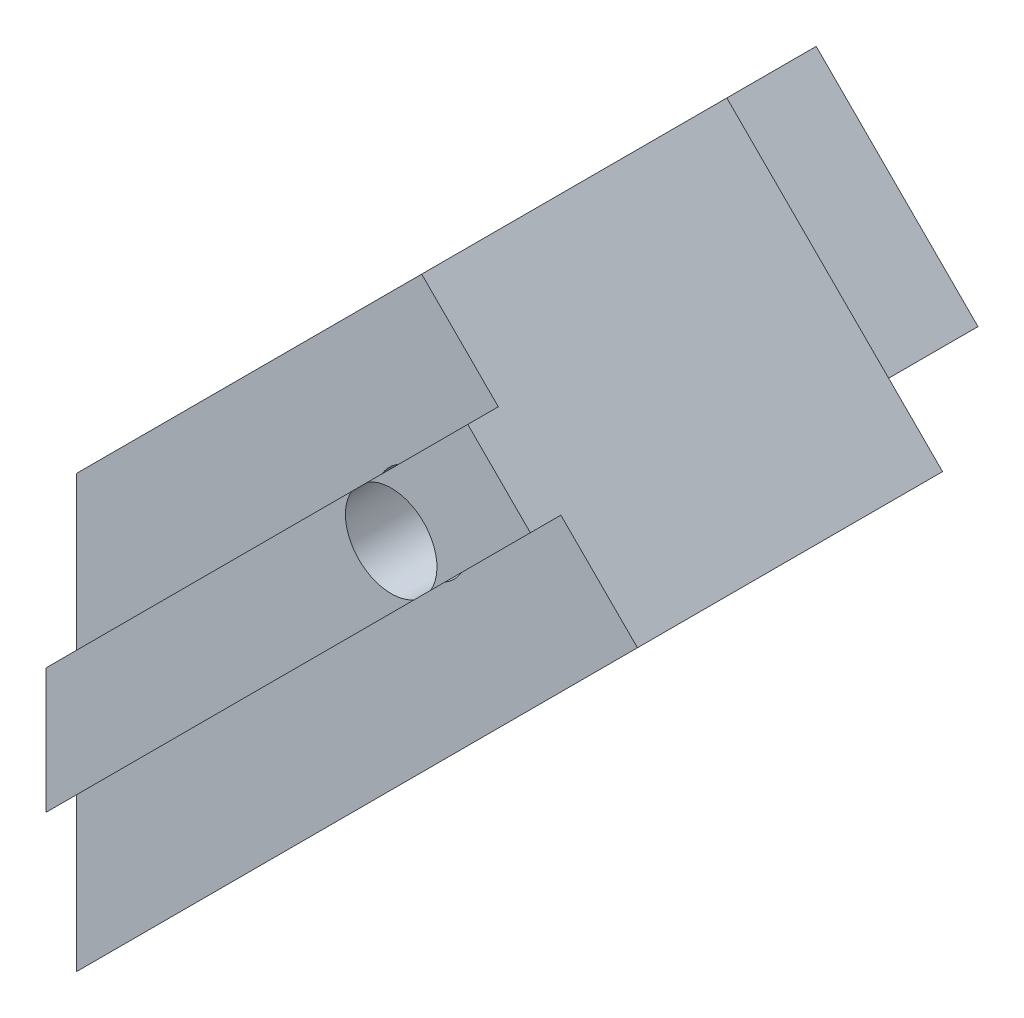
ISO-10303-21;
HEADER;
FILE_DESCRIPTION(('STEP AP214'),'2;1');
FILE_NAME('part.step','',(''),(''),'','','');
FILE_SCHEMA(('AUTOMOTIVE_DESIGN { 1 0 10303 214 1 1 1 1 }'));
ENDSEC;
DATA;
#1=APPLICATION_CONTEXT('core data for automotive mechanical design processes');
#2=APPLICATION_PROTOCOL_DEFINITION('international standard','automotive_design',2000,#1);
#3=PRODUCT_CONTEXT('',#1,'mechanical');
#4=PRODUCT('Part','Part','',(#3));
#5=PRODUCT_RELATED_PRODUCT_CATEGORY('part','',(#4));
#6=PRODUCT_DEFINITION_FORMATION('','',#4);
#7=PRODUCT_DEFINITION_CONTEXT('part definition',#1,'design');
#8=PRODUCT_DEFINITION('design','',#6,#7);
#9=PRODUCT_DEFINITION_SHAPE('','',#8);
#10=(LENGTH_UNIT() NAMED_UNIT(*) SI_UNIT(.MILLI.,.METRE.));
#11=(NAMED_UNIT(*) PLANE_ANGLE_UNIT() SI_UNIT($,.RADIAN.));
#12=(NAMED_UNIT(*) SI_UNIT($,.STERADIAN.) SOLID_ANGLE_UNIT());
#13=UNCERTAINTY_MEASURE_WITH_UNIT(LENGTH_MEASURE(1.E-05),#10,'distance_accuracy_value','');
#14=(GEOMETRIC_REPRESENTATION_CONTEXT(3) GLOBAL_UNCERTAINTY_ASSIGNED_CONTEXT((#13)) GLOBAL_UNIT_ASSIGNED_CONTEXT((#10,
#11,#12)) REPRESENTATION_CONTEXT('',''));
#15=CARTESIAN_POINT('',(0.,0.,0.));
#16=DIRECTION('',(0.,0.,1.));
#17=DIRECTION('',(1.,0.,0.));
#18=AXIS2_PLACEMENT_3D('',#15,#16,#17);
#19=CARTESIAN_POINT('',(11.3137084989846,18.3847763108503,21.));
#20=DIRECTION('',(0.,0.,-1.));
#21=DIRECTION('',(-1.,0.,0.));
#22=AXIS2_PLACEMENT_3D('',#19,#20,#21);
#23=CYLINDRICAL_SURFACE('',#22,1.5);
#24=CARTESIAN_POINT('',(11.3137084989846,18.3847763108503,21.));
#25=DIRECTION('',(0.,0.,-1.));
#26=DIRECTION('',(-1.,0.,0.));
#27=AXIS2_PLACEMENT_3D('',#24,#25,#26);
#28=CIRCLE('',#27,1.5);
#29=CARTESIAN_POINT('',(10.5599731785442,19.6816506558508,21.));
#30=VERTEX_POINT('',#29);
#31=CARTESIAN_POINT('',(12.6105828439851,17.6310409904097,21.));
#32=VERTEX_POINT('',#31);
#33=EDGE_CURVE('E11',#30,#32,#28,.T.);
#34=ORIENTED_EDGE('',*,*,#33,.F.);
#35=DIRECTION('',(0.,0.,-1.));
#36=VECTOR('',#35,1.);
#37=CARTESIAN_POINT('',(10.5599731785442,19.6816506558508,21.));
#38=LINE('',#37,#36);
#39=CARTESIAN_POINT('',(10.5599731785442,19.6816506558508,20.));
#40=VERTEX_POINT('',#39);
#41=EDGE_CURVE('E201',#40,#30,#38,.F.);
#42=ORIENTED_EDGE('',*,*,#41,.F.);
#43=CARTESIAN_POINT('',(11.3137084989846,18.3847763108503,20.));
#44=DIRECTION('',(0.,0.,1.));
#45=DIRECTION('',(1.,0.,0.));
#46=AXIS2_PLACEMENT_3D('',#43,#44,#45);
#47=CIRCLE('',#46,1.5);
#48=CARTESIAN_POINT('',(10.0168341539841,19.1385116312907,20.));
#49=VERTEX_POINT('',#48);
#50=EDGE_CURVE('E215',#40,#49,#47,.T.);
#51=ORIENTED_EDGE('',*,*,#50,.T.);
#52=DIRECTION('',(0.,0.,-1.));
#53=VECTOR('',#52,1.);
#54=CARTESIAN_POINT('',(10.0168341539841,19.1385116312907,21.));
#55=LINE('',#54,#53);
#56=CARTESIAN_POINT('',(10.0168341539841,19.1385116312907,21.));
#57=VERTEX_POINT('',#56);
#58=EDGE_CURVE('E49',#57,#49,#55,.T.);
#59=ORIENTED_EDGE('',*,*,#58,.F.);
#60=CARTESIAN_POINT('',(12.0674438194252,17.0879019658498,21.));
#61=VERTEX_POINT('',#60);
#62=EDGE_CURVE('E42',#61,#57,#28,.T.);
#63=ORIENTED_EDGE('',*,*,#62,.F.);
#64=DIRECTION('',(0.,0.,-1.));
#65=VECTOR('',#64,1.);
#66=CARTESIAN_POINT('',(12.0674438194252,17.0879019658498,21.));
#67=LINE('',#66,#65);
#68=CARTESIAN_POINT('',(12.0674438194252,17.0879019658498,20.));
#69=VERTEX_POINT('',#68);
#70=EDGE_CURVE('E404',#69,#61,#67,.F.);
#71=ORIENTED_EDGE('',*,*,#70,.F.);
#72=CARTESIAN_POINT('',(11.3137084989846,18.3847763108503,20.));
#73=DIRECTION('',(0.,0.,1.));
#74=DIRECTION('',(1.,0.,0.));
#75=AXIS2_PLACEMENT_3D('',#72,#73,#74);
#76=CIRCLE('',#75,1.5);
#77=CARTESIAN_POINT('',(12.6105828439851,17.6310409904097,20.));
#78=VERTEX_POINT('',#77);
#79=EDGE_CURVE('E402',#69,#78,#76,.T.);
#80=ORIENTED_EDGE('',*,*,#79,.T.);
#81=DIRECTION('',(0.,0.,-1.));
#82=VECTOR('',#81,1.);
#83=CARTESIAN_POINT('',(12.6105828439851,17.6310409904097,21.));
#84=LINE('',#83,#82);
#85=EDGE_CURVE('E204',#32,#78,#84,.T.);
#86=ORIENTED_EDGE('',*,*,#85,.F.);
#87=EDGE_LOOP('',(#34,#42,#51,#59,#63,#71,#80,#86));
#88=FACE_BOUND('',#87,.T.);
#89=CARTESIAN_POINT('',(11.3137084989846,18.3847763108503,17.5));
#90=DIRECTION('',(0.,0.,-1.));
#91=DIRECTION('',(-1.,0.,0.));
#92=AXIS2_PLACEMENT_3D('',#89,#90,#91);
#93=CIRCLE('',#92,1.5);
#94=CARTESIAN_POINT('',(9.81370849898462,18.3847763108503,17.5));
#95=VERTEX_POINT('',#94);
#96=EDGE_CURVE('E37',#95,#95,#93,.F.);
#97=ORIENTED_EDGE('',*,*,#96,.F.);
#98=EDGE_LOOP('',(#97));
#99=FACE_BOUND('',#98,.T.);
#100=ADVANCED_FACE('F33',(#88,#99),#23,.F.);
#101=CARTESIAN_POINT('',(15.8745472376379,20.8950053840626,21.));
#102=DIRECTION('',(-0.707106781186552,0.707106781186543,0.));
#103=DIRECTION('',(-0.707106781186543,-0.707106781186552,0.));
#104=AXIS2_PLACEMENT_3D('',#101,#102,#103);
#105=PLANE('',#104);
#106=DIRECTION('',(0.707106781186543,0.707106781186552,0.));
#107=VECTOR('',#106,1.);
#108=CARTESIAN_POINT('',(15.8745472376379,20.8950053840626,21.));
#109=LINE('',#108,#107);
#110=CARTESIAN_POINT('',(15.8745472376379,20.8950053840626,21.));
#111=VERTEX_POINT('',#110);
#112=EDGE_CURVE('E385',#32,#111,#109,.T.);
#113=ORIENTED_EDGE('',*,*,#112,.F.);
#114=ORIENTED_EDGE('',*,*,#85,.T.);
#115=DIRECTION('',(0.707106781186543,0.707106781186552,0.));
#116=VECTOR('',#115,1.);
#117=CARTESIAN_POINT('',(15.8745472376379,20.8950053840626,20.));
#118=LINE('',#117,#116);
#119=CARTESIAN_POINT('',(15.8745472376379,20.8950053840626,20.));
#120=VERTEX_POINT('',#119);
#121=EDGE_CURVE('E235',#78,#120,#118,.T.);
#122=ORIENTED_EDGE('',*,*,#121,.T.);
#123=DIRECTION('',(0.,0.,-1.));
#124=VECTOR('',#123,1.);
#125=CARTESIAN_POINT('',(15.8745472376379,20.8950053840626,21.));
#126=LINE('',#125,#124);
#127=EDGE_CURVE('E239',#111,#120,#126,.T.);
#128=ORIENTED_EDGE('',*,*,#127,.F.);
#129=EDGE_LOOP('',(#113,#114,#122,#128));
#130=FACE_BOUND('',#129,.T.);
#131=ADVANCED_FACE('F420',(#130),#105,.F.);
#132=CARTESIAN_POINT('',(0.,9.12167747730651,21.));
#133=DIRECTION('',(0.707106781186552,-0.707106781186543,0.));
#134=DIRECTION('',(0.707106781186543,0.707106781186552,0.));
#135=AXIS2_PLACEMENT_3D('',#132,#133,#134);
#136=PLANE('',#135);
#137=DIRECTION('',(-0.707106781186543,-0.707106781186552,0.));
#138=VECTOR('',#137,1.);
#139=CARTESIAN_POINT('',(0.,9.12167747730651,21.));
#140=LINE('',#139,#138);
#141=CARTESIAN_POINT('',(0.,9.12167747730651,21.));
#142=VERTEX_POINT('',#141);
#143=EDGE_CURVE('E222',#57,#142,#140,.T.);
#144=ORIENTED_EDGE('',*,*,#143,.F.);
#145=ORIENTED_EDGE('',*,*,#58,.T.);
#146=DIRECTION('',(-0.707106781186543,-0.707106781186552,0.));
#147=VECTOR('',#146,1.);
#148=CARTESIAN_POINT('',(0.,9.12167747730651,20.));
#149=LINE('',#148,#147);
#150=CARTESIAN_POINT('',(0.,9.12167747730651,20.));
#151=VERTEX_POINT('',#150);
#152=EDGE_CURVE('E234',#49,#151,#149,.T.);
#153=ORIENTED_EDGE('',*,*,#152,.T.);
#154=DIRECTION('',(0.,0.,-1.));
#155=VECTOR('',#154,1.);
#156=CARTESIAN_POINT('',(0.,9.12167747730651,21.));
#157=LINE('',#156,#155);
#158=EDGE_CURVE('E221',#142,#151,#157,.T.);
#159=ORIENTED_EDGE('',*,*,#158,.F.);
#160=EDGE_LOOP('',(#144,#145,#153,#159));
#161=FACE_BOUND('',#160,.T.);
#162=ADVANCED_FACE('F377',(#161),#136,.F.);
#163=CARTESIAN_POINT('',(0.,0.,21.));
#164=DIRECTION('',(0.,0.,-1.));
#165=DIRECTION('',(-1.,0.,0.));
#166=AXIS2_PLACEMENT_3D('',#163,#164,#165);
#167=PLANE('',#166);
#168=CARTESIAN_POINT('',(13.8239375721969,22.9456150495035,21.));
#169=VERTEX_POINT('',#168);
#170=EDGE_CURVE('E213',#169,#30,#140,.T.);
#171=ORIENTED_EDGE('',*,*,#170,.T.);
#172=ORIENTED_EDGE('',*,*,#33,.T.);
#173=ORIENTED_EDGE('',*,*,#112,.T.);
#174=DIRECTION('',(-0.707106781186551,0.707106781186544,0.));
#175=VECTOR('',#174,1.);
#176=CARTESIAN_POINT('',(13.8239375721969,22.9456150495035,21.));
#177=LINE('',#176,#175);
#178=EDGE_CURVE('E219',#111,#169,#177,.T.);
#179=ORIENTED_EDGE('',*,*,#178,.T.);
#180=EDGE_LOOP('',(#171,#172,#173,#179));
#181=FACE_BOUND('',#180,.T.);
#182=ADVANCED_FACE('F217',(#181),#167,.F.);
#183=CARTESIAN_POINT('',(0.,14.142135623731,20.));
#184=DIRECTION('',(0.707106781186552,-0.707106781186544,0.));
#185=DIRECTION('',(0.707106781186544,0.707106781186551,0.));
#186=AXIS2_PLACEMENT_3D('',#183,#184,#185);
#187=PLANE('',#186);
#188=CARTESIAN_POINT('',(1.06066017177974,15.2027957955108,5.));
#189=DIRECTION('',(0.707106781186552,-0.707106781186544,0.));
#190=DIRECTION('',(0.707106781186544,0.707106781186551,0.));
#191=AXIS2_PLACEMENT_3D('',#188,#189,#190);
#192=CIRCLE('',#191,1.25);
#193=CARTESIAN_POINT('',(1.94454364826292,16.086679271994,5.));
#194=VERTEX_POINT('',#193);
#195=EDGE_CURVE('E248',#194,#194,#192,.T.);
#196=ORIENTED_EDGE('',*,*,#195,.T.);
#197=EDGE_LOOP('',(#196));
#198=FACE_BOUND('',#197,.T.);
#199=DIRECTION('',(0.,0.,1.));
#200=VECTOR('',#199,1.);
#201=CARTESIAN_POINT('',(4.24264068711918,18.3847763108503,0.));
#202=LINE('',#201,#200);
#203=CARTESIAN_POINT('',(4.24264068711918,18.3847763108503,0.));
#204=VERTEX_POINT('',#203);
#205=CARTESIAN_POINT('',(4.24264068711918,18.3847763108503,10.));
#206=VERTEX_POINT('',#205);
#207=EDGE_CURVE('E393',#204,#206,#202,.T.);
#208=ORIENTED_EDGE('',*,*,#207,.F.);
#209=DIRECTION('',(-0.707106781186544,-0.707106781186552,0.));
#210=VECTOR('',#209,1.);
#211=CARTESIAN_POINT('',(0.,14.142135623731,0.));
#212=LINE('',#211,#210);
#213=CARTESIAN_POINT('',(0.,14.142135623731,0.));
#214=VERTEX_POINT('',#213);
#215=EDGE_CURVE('E320',#204,#214,#212,.T.);
#216=ORIENTED_EDGE('',*,*,#215,.T.);
#217=DIRECTION('',(0.,0.,-1.));
#218=VECTOR('',#217,1.);
#219=CARTESIAN_POINT('',(0.,14.142135623731,20.));
#220=LINE('',#219,#218);
#221=CARTESIAN_POINT('',(0.,14.142135623731,20.));
#222=VERTEX_POINT('',#221);
#223=EDGE_CURVE('E353',#222,#214,#220,.T.);
#224=ORIENTED_EDGE('',*,*,#223,.F.);
#225=DIRECTION('',(-0.707106781186544,-0.707106781186552,0.));
#226=VECTOR('',#225,1.);
#227=CARTESIAN_POINT('',(0.,14.142135623731,20.));
#228=LINE('',#227,#226);
#229=CARTESIAN_POINT('',(11.3137084989846,25.4558441227158,20.));
#230=VERTEX_POINT('',#229);
#231=EDGE_CURVE('E304',#230,#222,#228,.T.);
#232=ORIENTED_EDGE('',*,*,#231,.F.);
#233=DIRECTION('',(0.,0.,-1.));
#234=VECTOR('',#233,1.);
#235=CARTESIAN_POINT('',(11.3137084989846,25.4558441227158,20.));
#236=LINE('',#235,#234);
#237=CARTESIAN_POINT('',(11.3137084989846,25.4558441227158,10.));
#238=VERTEX_POINT('',#237);
#239=EDGE_CURVE('E356',#230,#238,#236,.T.);
#240=ORIENTED_EDGE('',*,*,#239,.T.);
#241=DIRECTION('',(0.707106781186548,0.707106781186548,0.));
#242=VECTOR('',#241,1.);
#243=CARTESIAN_POINT('',(4.94974746830573,19.0918830920369,10.));
#244=LINE('',#243,#242);
#245=EDGE_CURVE('E388',#206,#238,#244,.T.);
#246=ORIENTED_EDGE('',*,*,#245,.F.);
#247=EDGE_LOOP('',(#208,#216,#224,#232,#240,#246));
#248=FACE_BOUND('',#247,.T.);
#249=ADVANCED_FACE('F479',(#198,#248),#187,.F.);
#250=CARTESIAN_POINT('',(0.,0.,0.));
#251=DIRECTION('',(0.,0.,1.));
#252=DIRECTION('',(1.,0.,0.));
#253=AXIS2_PLACEMENT_3D('',#250,#251,#252);
#254=PLANE('',#253);
#255=DIRECTION('',(-0.707106781186547,0.707106781186548,0.));
#256=VECTOR('',#255,1.);
#257=CARTESIAN_POINT('',(4.24264068711918,18.3847763108503,0.));
#258=LINE('',#257,#256);
#259=CARTESIAN_POINT('',(9.54594154601833,13.0814754519512,0.));
#260=VERTEX_POINT('',#259);
#261=EDGE_CURVE('E396',#260,#204,#258,.T.);
#262=ORIENTED_EDGE('',*,*,#261,.F.);
#263=DIRECTION('',(0.707106781186544,0.707106781186551,0.));
#264=VECTOR('',#263,1.);
#265=CARTESIAN_POINT('',(1.76776695296634,5.30330085889912,0.));
#266=LINE('',#265,#264);
#267=CARTESIAN_POINT('',(1.76776695296634,5.30330085889912,0.));
#268=VERTEX_POINT('',#267);
#269=EDGE_CURVE('E282',#268,#260,#266,.T.);
#270=ORIENTED_EDGE('',*,*,#269,.F.);
#271=DIRECTION('',(0.707106781186551,-0.707106781186544,0.));
#272=VECTOR('',#271,1.);
#273=CARTESIAN_POINT('',(1.76776695296634,5.30330085889912,0.));
#274=LINE('',#273,#272);
#275=CARTESIAN_POINT('',(3.53553390593272,3.53553390593276,0.));
#276=VERTEX_POINT('',#275);
#277=EDGE_CURVE('E291',#268,#276,#274,.T.);
#278=ORIENTED_EDGE('',*,*,#277,.T.);
#279=DIRECTION('',(0.707106781186544,0.707106781186551,0.));
#280=VECTOR('',#279,1.);
#281=CARTESIAN_POINT('',(18.3847763108501,18.3847763108503,0.));
#282=LINE('',#281,#280);
#283=CARTESIAN_POINT('',(0.,0.,0.));
#284=VERTEX_POINT('',#283);
#285=EDGE_CURVE('E290',#284,#276,#282,.T.);
#286=ORIENTED_EDGE('',*,*,#285,.F.);
#287=DIRECTION('',(0.,-1.,0.));
#288=VECTOR('',#287,1.);
#289=CARTESIAN_POINT('',(0.,0.,0.));
#290=LINE('',#289,#288);
#291=CARTESIAN_POINT('',(0.,5.,0.));
#292=VERTEX_POINT('',#291);
#293=EDGE_CURVE('E300',#292,#284,#290,.T.);
#294=ORIENTED_EDGE('',*,*,#293,.F.);
#295=DIRECTION('',(1.,0.,0.));
#296=VECTOR('',#295,1.);
#297=CARTESIAN_POINT('',(0.,5.,0.));
#298=LINE('',#297,#296);
#299=CARTESIAN_POINT('',(-1.,5.,0.));
#300=VERTEX_POINT('',#299);
#301=EDGE_CURVE('E331',#300,#292,#298,.T.);
#302=ORIENTED_EDGE('',*,*,#301,.F.);
#303=DIRECTION('',(0.,-1.,0.));
#304=VECTOR('',#303,1.);
#305=CARTESIAN_POINT('',(-1.,5.,0.));
#306=LINE('',#305,#304);
#307=CARTESIAN_POINT('',(-1.,7.9,0.));
#308=VERTEX_POINT('',#307);
#309=EDGE_CURVE('E328',#308,#300,#306,.T.);
#310=ORIENTED_EDGE('',*,*,#309,.F.);
#311=DIRECTION('',(-1.,0.,0.));
#312=VECTOR('',#311,1.);
#313=CARTESIAN_POINT('',(-1.,7.9,0.));
#314=LINE('',#313,#312);
#315=CARTESIAN_POINT('',(0.,7.9,0.));
#316=VERTEX_POINT('',#315);
#317=EDGE_CURVE('E325',#316,#308,#314,.T.);
#318=ORIENTED_EDGE('',*,*,#317,.F.);
#319=DIRECTION('',(0.,-1.,0.));
#320=VECTOR('',#319,1.);
#321=CARTESIAN_POINT('',(0.,7.9,0.));
#322=LINE('',#321,#320);
#323=EDGE_CURVE('E322',#214,#316,#322,.T.);
#324=ORIENTED_EDGE('',*,*,#323,.F.);
#325=ORIENTED_EDGE('',*,*,#215,.F.);
#326=EDGE_LOOP('',(#262,#270,#278,#286,#294,#302,#310,#318,#324,#325));
#327=FACE_BOUND('',#326,.T.);
#328=ADVANCED_FACE('F463',(#327),#254,.F.);
#329=CARTESIAN_POINT('',(-1.76776695296638,1.76776695296636,0.));
#330=DIRECTION('',(-0.707106781186551,0.707106781186544,0.));
#331=DIRECTION('',(-0.707106781186544,-0.707106781186551,0.));
#332=AXIS2_PLACEMENT_3D('',#329,#330,#331);
#333=PLANE('',#332);
#334=CARTESIAN_POINT('',(6.36396103067888,9.8994949366117,5.));
#335=DIRECTION('',(0.707106781186551,-0.707106781186544,0.));
#336=DIRECTION('',(0.707106781186544,0.707106781186551,0.));
#337=AXIS2_PLACEMENT_3D('',#334,#335,#336);
#338=CIRCLE('',#337,1.25);
#339=CARTESIAN_POINT('',(7.24784450716206,10.7833784130949,5.));
#340=VERTEX_POINT('',#339);
#341=EDGE_CURVE('E245',#340,#340,#338,.T.);
#342=ORIENTED_EDGE('',*,*,#341,.F.);
#343=EDGE_LOOP('',(#342));
#344=FACE_BOUND('',#343,.T.);
#345=DIRECTION('',(0.,0.,-1.));
#346=VECTOR('',#345,1.);
#347=CARTESIAN_POINT('',(9.54594154601833,13.0814754519512,0.));
#348=LINE('',#347,#346);
#349=CARTESIAN_POINT('',(9.54594154601833,13.0814754519512,10.));
#350=VERTEX_POINT('',#349);
#351=EDGE_CURVE('E391',#350,#260,#348,.T.);
#352=ORIENTED_EDGE('',*,*,#351,.F.);
#353=DIRECTION('',(-0.707106781186544,-0.707106781186551,0.));
#354=VECTOR('',#353,1.);
#355=CARTESIAN_POINT('',(1.76776695296634,5.30330085889912,10.));
#356=LINE('',#355,#354);
#357=CARTESIAN_POINT('',(1.76776695296634,5.30330085889912,10.));
#358=VERTEX_POINT('',#357);
#359=EDGE_CURVE('E277',#350,#358,#356,.T.);
#360=ORIENTED_EDGE('',*,*,#359,.T.);
#361=DIRECTION('',(0.,0.,-1.));
#362=VECTOR('',#361,1.);
#363=CARTESIAN_POINT('',(1.76776695296634,5.30330085889912,10.));
#364=LINE('',#363,#362);
#365=EDGE_CURVE('E279',#358,#268,#364,.T.);
#366=ORIENTED_EDGE('',*,*,#365,.T.);
#367=ORIENTED_EDGE('',*,*,#269,.T.);
#368=EDGE_LOOP('',(#352,#360,#366,#367));
#369=FACE_BOUND('',#368,.T.);
#370=ADVANCED_FACE('F459',(#344,#369),#333,.F.);
#371=CARTESIAN_POINT('',(11.3137084989846,25.4558441227158,20.));
#372=DIRECTION('',(-0.707106781186543,-0.707106781186552,0.));
#373=DIRECTION('',(0.707106781186552,-0.707106781186543,0.));
#374=AXIS2_PLACEMENT_3D('',#371,#372,#373);
#375=PLANE('',#374);
#376=DIRECTION('',(0.707106781186551,-0.707106781186544,0.));
#377=VECTOR('',#376,1.);
#378=CARTESIAN_POINT('',(16.6170093578838,20.1525432638167,10.));
#379=LINE('',#378,#377);
#380=CARTESIAN_POINT('',(18.3847763108501,18.3847763108503,10.));
#381=VERTEX_POINT('',#380);
#382=EDGE_CURVE('E288',#238,#381,#379,.T.);
#383=ORIENTED_EDGE('',*,*,#382,.F.);
#384=ORIENTED_EDGE('',*,*,#239,.F.);
#385=DIRECTION('',(-0.707106781186552,0.707106781186543,0.));
#386=VECTOR('',#385,1.);
#387=CARTESIAN_POINT('',(11.3137084989846,25.4558441227158,20.));
#388=LINE('',#387,#386);
#389=CARTESIAN_POINT('',(13.8239375721969,22.9456150495035,20.));
#390=VERTEX_POINT('',#389);
#391=EDGE_CURVE('E299',#390,#230,#388,.T.);
#392=ORIENTED_EDGE('',*,*,#391,.F.);
#393=DIRECTION('',(0.,0.,-1.));
#394=VECTOR('',#393,1.);
#395=CARTESIAN_POINT('',(13.8239375721969,22.9456150495035,21.));
#396=LINE('',#395,#394);
#397=EDGE_CURVE('E225',#169,#390,#396,.T.);
#398=ORIENTED_EDGE('',*,*,#397,.F.);
#399=ORIENTED_EDGE('',*,*,#178,.F.);
#400=ORIENTED_EDGE('',*,*,#127,.T.);
#401=CARTESIAN_POINT('',(18.3847763108501,18.3847763108503,20.));
#402=VERTEX_POINT('',#401);
#403=EDGE_CURVE('E301',#402,#120,#388,.T.);
#404=ORIENTED_EDGE('',*,*,#403,.F.);
#405=DIRECTION('',(0.,0.,-1.));
#406=VECTOR('',#405,1.);
#407=CARTESIAN_POINT('',(18.3847763108501,18.3847763108503,20.));
#408=LINE('',#407,#406);
#409=EDGE_CURVE('E359',#402,#381,#408,.T.);
#410=ORIENTED_EDGE('',*,*,#409,.T.);
#411=EDGE_LOOP('',(#383,#384,#392,#398,#399,#400,#404,#410));
#412=FACE_BOUND('',#411,.T.);
#413=ADVANCED_FACE('F462',(#412),#375,.F.);
#414=CARTESIAN_POINT('',(0.,0.,20.));
#415=DIRECTION('',(0.,0.,1.));
#416=DIRECTION('',(1.,0.,0.));
#417=AXIS2_PLACEMENT_3D('',#414,#415,#416);
#418=PLANE('',#417);
#419=ORIENTED_EDGE('',*,*,#50,.F.);
#420=EDGE_CURVE('E214',#390,#40,#149,.T.);
#421=ORIENTED_EDGE('',*,*,#420,.F.);
#422=ORIENTED_EDGE('',*,*,#391,.T.);
#423=ORIENTED_EDGE('',*,*,#231,.T.);
#424=DIRECTION('',(0.,-1.,0.));
#425=VECTOR('',#424,1.);
#426=CARTESIAN_POINT('',(0.,7.9,20.));
#427=LINE('',#426,#425);
#428=EDGE_CURVE('E306',#222,#151,#427,.T.);
#429=ORIENTED_EDGE('',*,*,#428,.T.);
#430=ORIENTED_EDGE('',*,*,#152,.F.);
#431=EDGE_LOOP('',(#419,#421,#422,#423,#429,#430));
#432=FACE_BOUND('',#431,.T.);
#433=ADVANCED_FACE('F476',(#432),#418,.T.);
#434=CARTESIAN_POINT('',(-1.,7.9,20.));
#435=DIRECTION('',(0.,-1.,0.));
#436=DIRECTION('',(0.,0.,-1.));
#437=AXIS2_PLACEMENT_3D('',#434,#435,#436);
#438=PLANE('',#437);
#439=DIRECTION('',(0.,0.,-1.));
#440=VECTOR('',#439,1.);
#441=CARTESIAN_POINT('',(0.,7.9,20.));
#442=LINE('',#441,#440);
#443=CARTESIAN_POINT('',(0.,7.9,20.));
#444=VERTEX_POINT('',#443);
#445=CARTESIAN_POINT('',(0.,7.9,15.3840572873934));
#446=VERTEX_POINT('',#445);
#447=EDGE_CURVE('E350',#444,#446,#442,.T.);
#448=ORIENTED_EDGE('',*,*,#447,.T.);
#449=DIRECTION('',(-1.,0.,0.));
#450=VECTOR('',#449,1.);
#451=CARTESIAN_POINT('',(18.3847763108501,7.9,15.3840572873934));
#452=LINE('',#451,#450);
#453=CARTESIAN_POINT('',(-1.,7.9,15.3840572873934));
#454=VERTEX_POINT('',#453);
#455=EDGE_CURVE('E273',#446,#454,#452,.T.);
#456=ORIENTED_EDGE('',*,*,#455,.T.);
#457=DIRECTION('',(0.,0.,-1.));
#458=VECTOR('',#457,1.);
#459=CARTESIAN_POINT('',(-1.,7.9,20.));
#460=LINE('',#459,#458);
#461=CARTESIAN_POINT('',(-1.,7.9,20.));
#462=VERTEX_POINT('',#461);
#463=EDGE_CURVE('E346',#462,#454,#460,.T.);
#464=ORIENTED_EDGE('',*,*,#463,.F.);
#465=DIRECTION('',(-1.,0.,0.));
#466=VECTOR('',#465,1.);
#467=CARTESIAN_POINT('',(-1.,7.9,20.));
#468=LINE('',#467,#466);
#469=EDGE_CURVE('E309',#444,#462,#468,.T.);
#470=ORIENTED_EDGE('',*,*,#469,.F.);
#471=EDGE_LOOP('',(#448,#456,#464,#470));
#472=FACE_BOUND('',#471,.T.);
#473=ADVANCED_FACE('F498',(#472),#438,.F.);
#474=CARTESIAN_POINT('',(-1.,5.,20.));
#475=DIRECTION('',(1.,0.,0.));
#476=DIRECTION('',(0.,1.,0.));
#477=AXIS2_PLACEMENT_3D('',#474,#475,#476);
#478=PLANE('',#477);
#479=ORIENTED_EDGE('',*,*,#463,.T.);
#480=CARTESIAN_POINT('',(-1.,6.45,15.));
#481=DIRECTION('',(-1.,0.,0.));
#482=DIRECTION('',(0.,0.,1.));
#483=AXIS2_PLACEMENT_3D('',#480,#481,#482);
#484=CIRCLE('',#483,1.5);
#485=CARTESIAN_POINT('',(-1.,5.,15.3840572873934));
#486=VERTEX_POINT('',#485);
#487=EDGE_CURVE('E258',#486,#454,#484,.T.);
#488=ORIENTED_EDGE('',*,*,#487,.F.);
#489=DIRECTION('',(0.,0.,-1.));
#490=VECTOR('',#489,1.);
#491=CARTESIAN_POINT('',(-1.,5.,20.));
#492=LINE('',#491,#490);
#493=CARTESIAN_POINT('',(-1.,5.,20.));
#494=VERTEX_POINT('',#493);
#495=EDGE_CURVE('E342',#494,#486,#492,.T.);
#496=ORIENTED_EDGE('',*,*,#495,.F.);
#497=DIRECTION('',(0.,-1.,0.));
#498=VECTOR('',#497,1.);
#499=CARTESIAN_POINT('',(-1.,5.,20.));
#500=LINE('',#499,#498);
#501=EDGE_CURVE('E311',#462,#494,#500,.T.);
#502=ORIENTED_EDGE('',*,*,#501,.F.);
#503=EDGE_LOOP('',(#479,#488,#496,#502));
#504=FACE_BOUND('',#503,.T.);
#505=ADVANCED_FACE('F494',(#504),#478,.F.);
#506=CARTESIAN_POINT('',(0.,5.,20.));
#507=DIRECTION('',(0.,1.,0.));
#508=DIRECTION('',(0.,0.,1.));
#509=AXIS2_PLACEMENT_3D('',#506,#507,#508);
#510=PLANE('',#509);
#511=DIRECTION('',(0.,0.,-1.));
#512=VECTOR('',#511,1.);
#513=CARTESIAN_POINT('',(0.,5.,20.));
#514=LINE('',#513,#512);
#515=CARTESIAN_POINT('',(0.,5.,14.6159427126066));
#516=VERTEX_POINT('',#515);
#517=EDGE_CURVE('E337',#516,#292,#514,.T.);
#518=ORIENTED_EDGE('',*,*,#517,.F.);
#519=DIRECTION('',(-1.,0.,0.));
#520=VECTOR('',#519,1.);
#521=CARTESIAN_POINT('',(18.3847763108501,5.,14.6159427126066));
#522=LINE('',#521,#520);
#523=CARTESIAN_POINT('',(-1.,5.,14.6159427126066));
#524=VERTEX_POINT('',#523);
#525=EDGE_CURVE('E264',#516,#524,#522,.T.);
#526=ORIENTED_EDGE('',*,*,#525,.T.);
#527=EDGE_CURVE('E341',#524,#300,#492,.T.);
#528=ORIENTED_EDGE('',*,*,#527,.T.);
#529=ORIENTED_EDGE('',*,*,#301,.T.);
#530=EDGE_LOOP('',(#518,#526,#528,#529));
#531=FACE_BOUND('',#530,.T.);
#532=ADVANCED_FACE('F489',(#531),#510,.F.);
#533=CARTESIAN_POINT('',(18.3847763108501,18.3847763108503,20.));
#534=DIRECTION('',(-0.707106781186551,0.707106781186544,0.));
#535=DIRECTION('',(-0.707106781186544,-0.707106781186551,0.));
#536=AXIS2_PLACEMENT_3D('',#533,#534,#535);
#537=PLANE('',#536);
#538=DIRECTION('',(0.,0.,1.));
#539=VECTOR('',#538,1.);
#540=CARTESIAN_POINT('',(3.,3.00000000000003,20.));
#541=LINE('',#540,#539);
#542=CARTESIAN_POINT('',(3.,3.00000000000003,12.7847122083124));
#543=VERTEX_POINT('',#542);
#544=CARTESIAN_POINT('',(3.,3.00000000000003,17.2152877916876));
#545=VERTEX_POINT('',#544);
#546=EDGE_CURVE('E255',#543,#545,#541,.T.);
#547=ORIENTED_EDGE('',*,*,#546,.T.);
#548=CARTESIAN_POINT('',(6.44999999999993,6.45,15.));
#549=DIRECTION('',(-0.707106781186551,0.707106781186544,0.));
#550=DIRECTION('',(-0.707106781186544,-0.707106781186551,0.));
#551=AXIS2_PLACEMENT_3D('',#548,#549,#550);
#552=ELLIPSE('',#551,5.79827560572966,4.1);
#553=EDGE_CURVE('E232',#545,#543,#552,.T.);
#554=ORIENTED_EDGE('',*,*,#553,.T.);
#555=EDGE_LOOP('',(#547,#554));
#556=FACE_BOUND('',#555,.T.);
#557=DIRECTION('',(0.,0.,-1.));
#558=VECTOR('',#557,1.);
#559=CARTESIAN_POINT('',(3.53553390593272,3.53553390593276,10.));
#560=LINE('',#559,#558);
#561=CARTESIAN_POINT('',(3.53553390593272,3.53553390593276,10.));
#562=VERTEX_POINT('',#561);
#563=EDGE_CURVE('E280',#562,#276,#560,.T.);
#564=ORIENTED_EDGE('',*,*,#563,.F.);
#565=DIRECTION('',(-0.707106781186544,-0.707106781186551,0.));
#566=VECTOR('',#565,1.);
#567=CARTESIAN_POINT('',(3.53553390593272,3.53553390593276,10.));
#568=LINE('',#567,#566);
#569=EDGE_CURVE('E276',#381,#562,#568,.T.);
#570=ORIENTED_EDGE('',*,*,#569,.F.);
#571=ORIENTED_EDGE('',*,*,#409,.F.);
#572=DIRECTION('',(0.707106781186544,0.707106781186551,0.));
#573=VECTOR('',#572,1.);
#574=CARTESIAN_POINT('',(18.3847763108501,18.3847763108503,20.));
#575=LINE('',#574,#573);
#576=CARTESIAN_POINT('',(0.,0.,20.));
#577=VERTEX_POINT('',#576);
#578=EDGE_CURVE('E296',#577,#402,#575,.T.);
#579=ORIENTED_EDGE('',*,*,#578,.F.);
#580=DIRECTION('',(0.,0.,-1.));
#581=VECTOR('',#580,1.);
#582=CARTESIAN_POINT('',(0.,0.,20.));
#583=LINE('',#582,#581);
#584=EDGE_CURVE('E317',#577,#284,#583,.T.);
#585=ORIENTED_EDGE('',*,*,#584,.T.);
#586=ORIENTED_EDGE('',*,*,#285,.T.);
#587=EDGE_LOOP('',(#564,#570,#571,#579,#585,#586));
#588=FACE_BOUND('',#587,.T.);
#589=ADVANCED_FACE('F35',(#556,#588),#537,.F.);
#590=CARTESIAN_POINT('',(0.,7.9,20.));
#591=DIRECTION('',(1.,0.,0.));
#592=DIRECTION('',(0.,0.,-1.));
#593=AXIS2_PLACEMENT_3D('',#590,#591,#592);
#594=PLANE('',#593);
#595=CARTESIAN_POINT('',(0.,7.9,14.6159427126066));
#596=VERTEX_POINT('',#595);
#597=EDGE_CURVE('E349',#596,#316,#442,.T.);
#598=ORIENTED_EDGE('',*,*,#597,.F.);
#599=CARTESIAN_POINT('',(0.,6.45,15.));
#600=DIRECTION('',(1.,0.,0.));
#601=DIRECTION('',(0.,0.,-1.));
#602=AXIS2_PLACEMENT_3D('',#599,#600,#601);
#603=CIRCLE('',#602,1.5);
#604=EDGE_CURVE('E270',#596,#446,#603,.T.);
#605=ORIENTED_EDGE('',*,*,#604,.T.);
#606=ORIENTED_EDGE('',*,*,#447,.F.);
#607=DIRECTION('',(0.,-1.,0.));
#608=VECTOR('',#607,1.);
#609=CARTESIAN_POINT('',(0.,5.02045814642449,20.));
#610=LINE('',#609,#608);
#611=CARTESIAN_POINT('',(0.,5.02045814642449,20.));
#612=VERTEX_POINT('',#611);
#613=EDGE_CURVE('E230',#444,#612,#610,.T.);
#614=ORIENTED_EDGE('',*,*,#613,.T.);
#615=DIRECTION('',(0.,0.,-1.));
#616=VECTOR('',#615,1.);
#617=CARTESIAN_POINT('',(0.,5.02045814642449,21.));
#618=LINE('',#617,#616);
#619=CARTESIAN_POINT('',(0.,5.02045814642449,21.));
#620=VERTEX_POINT('',#619);
#621=EDGE_CURVE('E242',#620,#612,#618,.T.);
#622=ORIENTED_EDGE('',*,*,#621,.F.);
#623=DIRECTION('',(0.,-1.,0.));
#624=VECTOR('',#623,1.);
#625=CARTESIAN_POINT('',(0.,5.02045814642449,21.));
#626=LINE('',#625,#624);
#627=EDGE_CURVE('E236',#142,#620,#626,.T.);
#628=ORIENTED_EDGE('',*,*,#627,.F.);
#629=ORIENTED_EDGE('',*,*,#158,.T.);
#630=ORIENTED_EDGE('',*,*,#428,.F.);
#631=ORIENTED_EDGE('',*,*,#223,.T.);
#632=ORIENTED_EDGE('',*,*,#323,.T.);
#633=EDGE_LOOP('',(#598,#605,#606,#614,#622,#628,#629,#630,#631,#632));
#634=FACE_BOUND('',#633,.T.);
#635=ADVANCED_FACE('F384',(#634),#594,.F.);
#636=CARTESIAN_POINT('',(-1.,7.9,14.6159427126066));
#637=VERTEX_POINT('',#636);
#638=EDGE_CURVE('E345',#637,#308,#460,.T.);
#639=ORIENTED_EDGE('',*,*,#638,.F.);
#640=DIRECTION('',(-1.,0.,0.));
#641=VECTOR('',#640,1.);
#642=CARTESIAN_POINT('',(18.3847763108501,7.9,14.6159427126066));
#643=LINE('',#642,#641);
#644=EDGE_CURVE('E267',#637,#596,#643,.F.);
#645=ORIENTED_EDGE('',*,*,#644,.T.);
#646=ORIENTED_EDGE('',*,*,#597,.T.);
#647=ORIENTED_EDGE('',*,*,#317,.T.);
#648=EDGE_LOOP('',(#639,#645,#646,#647));
#649=FACE_BOUND('',#648,.T.);
#650=ADVANCED_FACE('F492',(#649),#438,.F.);
#651=ORIENTED_EDGE('',*,*,#527,.F.);
#652=EDGE_CURVE('E260',#637,#524,#484,.T.);
#653=ORIENTED_EDGE('',*,*,#652,.F.);
#654=ORIENTED_EDGE('',*,*,#638,.T.);
#655=ORIENTED_EDGE('',*,*,#309,.T.);
#656=EDGE_LOOP('',(#651,#653,#654,#655));
#657=FACE_BOUND('',#656,.T.);
#658=ADVANCED_FACE('F487',(#657),#478,.F.);
#659=ORIENTED_EDGE('',*,*,#495,.T.);
#660=DIRECTION('',(-1.,0.,0.));
#661=VECTOR('',#660,1.);
#662=CARTESIAN_POINT('',(18.3847763108501,5.,15.3840572873934));
#663=LINE('',#662,#661);
#664=CARTESIAN_POINT('',(0.,5.,15.3840572873934));
#665=VERTEX_POINT('',#664);
#666=EDGE_CURVE('E261',#486,#665,#663,.F.);
#667=ORIENTED_EDGE('',*,*,#666,.T.);
#668=CARTESIAN_POINT('',(0.,5.,20.));
#669=VERTEX_POINT('',#668);
#670=EDGE_CURVE('E338',#669,#665,#514,.T.);
#671=ORIENTED_EDGE('',*,*,#670,.F.);
#672=DIRECTION('',(1.,0.,0.));
#673=VECTOR('',#672,1.);
#674=CARTESIAN_POINT('',(0.,5.,20.));
#675=LINE('',#674,#673);
#676=EDGE_CURVE('E313',#494,#669,#675,.T.);
#677=ORIENTED_EDGE('',*,*,#676,.F.);
#678=EDGE_LOOP('',(#659,#667,#671,#677));
#679=FACE_BOUND('',#678,.T.);
#680=ADVANCED_FACE('F483',(#679),#510,.F.);
#681=CARTESIAN_POINT('',(0.,0.,20.));
#682=DIRECTION('',(1.,0.,0.));
#683=DIRECTION('',(0.,0.,-1.));
#684=AXIS2_PLACEMENT_3D('',#681,#682,#683);
#685=PLANE('',#684);
#686=ORIENTED_EDGE('',*,*,#670,.T.);
#687=CARTESIAN_POINT('',(0.,6.45,15.));
#688=DIRECTION('',(1.,0.,0.));
#689=DIRECTION('',(0.,0.,-1.));
#690=AXIS2_PLACEMENT_3D('',#687,#688,#689);
#691=CIRCLE('',#690,1.5);
#692=EDGE_CURVE('E362',#665,#516,#691,.T.);
#693=ORIENTED_EDGE('',*,*,#692,.T.);
#694=ORIENTED_EDGE('',*,*,#517,.T.);
#695=ORIENTED_EDGE('',*,*,#293,.T.);
#696=ORIENTED_EDGE('',*,*,#584,.F.);
#697=DIRECTION('',(0.,-1.,0.));
#698=VECTOR('',#697,1.);
#699=CARTESIAN_POINT('',(0.,0.,20.));
#700=LINE('',#699,#698);
#701=EDGE_CURVE('E315',#669,#577,#700,.T.);
#702=ORIENTED_EDGE('',*,*,#701,.F.);
#703=EDGE_LOOP('',(#686,#693,#694,#695,#696,#702));
#704=FACE_BOUND('',#703,.T.);
#705=ADVANCED_FACE('F475',(#704),#685,.F.);
#706=ORIENTED_EDGE('',*,*,#79,.F.);
#707=EDGE_CURVE('E57',#612,#69,#118,.T.);
#708=ORIENTED_EDGE('',*,*,#707,.F.);
#709=ORIENTED_EDGE('',*,*,#613,.F.);
#710=ORIENTED_EDGE('',*,*,#469,.T.);
#711=ORIENTED_EDGE('',*,*,#501,.T.);
#712=ORIENTED_EDGE('',*,*,#676,.T.);
#713=ORIENTED_EDGE('',*,*,#701,.T.);
#714=ORIENTED_EDGE('',*,*,#578,.T.);
#715=ORIENTED_EDGE('',*,*,#403,.T.);
#716=ORIENTED_EDGE('',*,*,#121,.F.);
#717=EDGE_LOOP('',(#706,#708,#709,#710,#711,#712,#713,#714,#715,#716));
#718=FACE_BOUND('',#717,.T.);
#719=ADVANCED_FACE('F471',(#718),#418,.T.);
#720=CARTESIAN_POINT('',(1.76776695296634,5.30330085889912,10.));
#721=DIRECTION('',(0.,0.,1.));
#722=DIRECTION('',(1.,0.,0.));
#723=AXIS2_PLACEMENT_3D('',#720,#721,#722);
#724=PLANE('',#723);
#725=CARTESIAN_POINT('',(11.3137084989846,18.3847763108503,10.));
#726=DIRECTION('',(0.,0.,-1.));
#727=DIRECTION('',(-1.,0.,0.));
#728=AXIS2_PLACEMENT_3D('',#725,#726,#727);
#729=CIRCLE('',#728,4.1);
#730=CARTESIAN_POINT('',(7.21370849898462,18.3847763108503,10.));
#731=VERTEX_POINT('',#730);
#732=EDGE_CURVE('E408',#731,#731,#729,.T.);
#733=ORIENTED_EDGE('',*,*,#732,.F.);
#734=EDGE_LOOP('',(#733));
#735=FACE_BOUND('',#734,.T.);
#736=ORIENTED_EDGE('',*,*,#359,.F.);
#737=DIRECTION('',(-0.707106781186547,0.707106781186548,0.));
#738=VECTOR('',#737,1.);
#739=CARTESIAN_POINT('',(4.24264068711918,18.3847763108503,10.));
#740=LINE('',#739,#738);
#741=EDGE_CURVE('E397',#350,#206,#740,.T.);
#742=ORIENTED_EDGE('',*,*,#741,.T.);
#743=ORIENTED_EDGE('',*,*,#245,.T.);
#744=ORIENTED_EDGE('',*,*,#382,.T.);
#745=ORIENTED_EDGE('',*,*,#569,.T.);
#746=DIRECTION('',(0.707106781186551,-0.707106781186544,0.));
#747=VECTOR('',#746,1.);
#748=CARTESIAN_POINT('',(1.76776695296634,5.30330085889912,10.));
#749=LINE('',#748,#747);
#750=EDGE_CURVE('E285',#358,#562,#749,.T.);
#751=ORIENTED_EDGE('',*,*,#750,.F.);
#752=EDGE_LOOP('',(#736,#742,#743,#744,#745,#751));
#753=FACE_BOUND('',#752,.T.);
#754=ADVANCED_FACE('F467',(#735,#753),#724,.F.);
#755=CARTESIAN_POINT('',(1.76776695296634,5.30330085889912,10.));
#756=DIRECTION('',(-0.707106781186544,-0.707106781186551,0.));
#757=DIRECTION('',(0.707106781186551,-0.707106781186544,0.));
#758=AXIS2_PLACEMENT_3D('',#755,#756,#757);
#759=PLANE('',#758);
#760=ORIENTED_EDGE('',*,*,#563,.T.);
#761=ORIENTED_EDGE('',*,*,#277,.F.);
#762=ORIENTED_EDGE('',*,*,#365,.F.);
#763=ORIENTED_EDGE('',*,*,#750,.T.);
#764=EDGE_LOOP('',(#760,#761,#762,#763));
#765=FACE_BOUND('',#764,.T.);
#766=ADVANCED_FACE('F457',(#765),#759,.F.);
#767=CARTESIAN_POINT('',(18.3847763108501,6.45,15.));
#768=DIRECTION('',(-1.,0.,0.));
#769=DIRECTION('',(0.,0.,1.));
#770=AXIS2_PLACEMENT_3D('',#767,#768,#769);
#771=CYLINDRICAL_SURFACE('',#770,1.5);
#772=CARTESIAN_POINT('',(3.,6.45,15.));
#773=DIRECTION('',(-1.,0.,0.));
#774=DIRECTION('',(0.,0.,1.));
#775=AXIS2_PLACEMENT_3D('',#772,#773,#774);
#776=CIRCLE('',#775,1.5);
#777=CARTESIAN_POINT('',(3.,6.45,16.5));
#778=VERTEX_POINT('',#777);
#779=EDGE_CURVE('E254',#778,#778,#776,.F.);
#780=ORIENTED_EDGE('',*,*,#779,.T.);
#781=EDGE_LOOP('',(#780));
#782=FACE_BOUND('',#781,.T.);
#783=ORIENTED_EDGE('',*,*,#604,.F.);
#784=ORIENTED_EDGE('',*,*,#644,.F.);
#785=ORIENTED_EDGE('',*,*,#652,.T.);
#786=ORIENTED_EDGE('',*,*,#525,.F.);
#787=ORIENTED_EDGE('',*,*,#692,.F.);
#788=ORIENTED_EDGE('',*,*,#666,.F.);
#789=ORIENTED_EDGE('',*,*,#487,.T.);
#790=ORIENTED_EDGE('',*,*,#455,.F.);
#791=EDGE_LOOP('',(#783,#784,#785,#786,#787,#788,#789,#790));
#792=FACE_BOUND('',#791,.T.);
#793=ADVANCED_FACE('F453',(#782,#792),#771,.F.);
#794=CARTESIAN_POINT('',(18.3847763108501,6.45,15.));
#795=DIRECTION('',(-1.,0.,0.));
#796=DIRECTION('',(0.,0.,1.));
#797=AXIS2_PLACEMENT_3D('',#794,#795,#796);
#798=CYLINDRICAL_SURFACE('',#797,4.1);
#799=CARTESIAN_POINT('',(3.,6.45,15.));
#800=DIRECTION('',(-1.,0.,0.));
#801=DIRECTION('',(0.,0.,1.));
#802=AXIS2_PLACEMENT_3D('',#799,#800,#801);
#803=CIRCLE('',#802,4.1);
#804=EDGE_CURVE('E251',#545,#543,#803,.T.);
#805=ORIENTED_EDGE('',*,*,#804,.T.);
#806=ORIENTED_EDGE('',*,*,#553,.F.);
#807=EDGE_LOOP('',(#805,#806));
#808=FACE_BOUND('',#807,.T.);
#809=ADVANCED_FACE('F449',(#808),#798,.F.);
#810=CARTESIAN_POINT('',(3.,6.45,15.));
#811=DIRECTION('',(-1.,0.,0.));
#812=DIRECTION('',(0.,0.,1.));
#813=AXIS2_PLACEMENT_3D('',#810,#811,#812);
#814=PLANE('',#813);
#815=ORIENTED_EDGE('',*,*,#779,.F.);
#816=EDGE_LOOP('',(#815));
#817=FACE_BOUND('',#816,.T.);
#818=ORIENTED_EDGE('',*,*,#804,.F.);
#819=ORIENTED_EDGE('',*,*,#546,.F.);
#820=EDGE_LOOP('',(#818,#819));
#821=FACE_BOUND('',#820,.T.);
#822=ADVANCED_FACE('F445',(#817,#821),#814,.F.);
#823=CARTESIAN_POINT('',(-5.09619407771264,21.3596500450031,5.));
#824=DIRECTION('',(0.707106781186551,-0.707106781186544,0.));
#825=DIRECTION('',(0.707106781186544,0.707106781186551,0.));
#826=AXIS2_PLACEMENT_3D('',#823,#824,#825);
#827=CYLINDRICAL_SURFACE('',#826,1.25);
#828=ORIENTED_EDGE('',*,*,#341,.T.);
#829=EDGE_LOOP('',(#828));
#830=FACE_BOUND('',#829,.T.);
#831=ORIENTED_EDGE('',*,*,#195,.F.);
#832=EDGE_LOOP('',(#831));
#833=FACE_BOUND('',#832,.T.);
#834=ADVANCED_FACE('F441',(#830,#833),#827,.F.);
#835=ORIENTED_EDGE('',*,*,#707,.T.);
#836=ORIENTED_EDGE('',*,*,#70,.T.);
#837=EDGE_CURVE('E374',#620,#61,#109,.T.);
#838=ORIENTED_EDGE('',*,*,#837,.F.);
#839=ORIENTED_EDGE('',*,*,#621,.T.);
#840=EDGE_LOOP('',(#835,#836,#838,#839));
#841=FACE_BOUND('',#840,.T.);
#842=ADVANCED_FACE('F427',(#841),#105,.F.);
#843=ORIENTED_EDGE('',*,*,#420,.T.);
#844=ORIENTED_EDGE('',*,*,#41,.T.);
#845=ORIENTED_EDGE('',*,*,#170,.F.);
#846=ORIENTED_EDGE('',*,*,#397,.T.);
#847=EDGE_LOOP('',(#843,#844,#845,#846));
#848=FACE_BOUND('',#847,.T.);
#849=ADVANCED_FACE('F211',(#848),#136,.F.);
#850=ORIENTED_EDGE('',*,*,#837,.T.);
#851=ORIENTED_EDGE('',*,*,#62,.T.);
#852=ORIENTED_EDGE('',*,*,#143,.T.);
#853=ORIENTED_EDGE('',*,*,#627,.T.);
#854=EDGE_LOOP('',(#850,#851,#852,#853));
#855=FACE_BOUND('',#854,.T.);
#856=ADVANCED_FACE('F371',(#855),#167,.F.);
#857=CARTESIAN_POINT('',(4.24264068711918,18.3847763108503,0.));
#858=DIRECTION('',(0.707106781186548,0.707106781186547,0.));
#859=DIRECTION('',(-0.707106781186547,0.707106781186548,0.));
#860=AXIS2_PLACEMENT_3D('',#857,#858,#859);
#861=PLANE('',#860);
#862=ORIENTED_EDGE('',*,*,#351,.T.);
#863=ORIENTED_EDGE('',*,*,#261,.T.);
#864=ORIENTED_EDGE('',*,*,#207,.T.);
#865=ORIENTED_EDGE('',*,*,#741,.F.);
#866=EDGE_LOOP('',(#862,#863,#864,#865));
#867=FACE_BOUND('',#866,.T.);
#868=ADVANCED_FACE('F432',(#867),#861,.T.);
#869=CARTESIAN_POINT('',(11.3137084989846,18.3847763108503,17.5));
#870=DIRECTION('',(0.,0.,-1.));
#871=DIRECTION('',(-1.,0.,0.));
#872=AXIS2_PLACEMENT_3D('',#869,#870,#871);
#873=PLANE('',#872);
#874=CARTESIAN_POINT('',(11.3137084989846,18.3847763108503,17.5));
#875=DIRECTION('',(0.,0.,-1.));
#876=DIRECTION('',(-1.,0.,0.));
#877=AXIS2_PLACEMENT_3D('',#874,#875,#876);
#878=CIRCLE('',#877,4.1);
#879=CARTESIAN_POINT('',(7.21370849898462,18.3847763108503,17.5));
#880=VERTEX_POINT('',#879);
#881=EDGE_CURVE('E411',#880,#880,#878,.T.);
#882=ORIENTED_EDGE('',*,*,#881,.T.);
#883=EDGE_LOOP('',(#882));
#884=FACE_BOUND('',#883,.T.);
#885=ORIENTED_EDGE('',*,*,#96,.T.);
#886=EDGE_LOOP('',(#885));
#887=FACE_BOUND('',#886,.T.);
#888=ADVANCED_FACE('F418',(#884,#887),#873,.T.);
#889=CARTESIAN_POINT('',(11.3137084989846,18.3847763108503,17.5));
#890=DIRECTION('',(0.,0.,-1.));
#891=DIRECTION('',(-1.,0.,0.));
#892=AXIS2_PLACEMENT_3D('',#889,#890,#891);
#893=CYLINDRICAL_SURFACE('',#892,4.1);
#894=ORIENTED_EDGE('',*,*,#881,.F.);
#895=EDGE_LOOP('',(#894));
#896=FACE_BOUND('',#895,.T.);
#897=ORIENTED_EDGE('',*,*,#732,.T.);
#898=EDGE_LOOP('',(#897));
#899=FACE_BOUND('',#898,.T.);
#900=ADVANCED_FACE('F430',(#896,#899),#893,.F.);
#901=CLOSED_SHELL('',(#100,#131,#162,#182,#249,#328,#370,#413,#433,#473,#505,#532,#589,#635,
#650,#658,#680,#705,#719,#754,#766,#793,#809,#822,#834,#842,#849,#856,#868,#888,#900));
#902=MANIFOLD_SOLID_BREP('B2',#901);
#903=ADVANCED_BREP_SHAPE_REPRESENTATION('',(#18,#902),#14);
#904=SHAPE_DEFINITION_REPRESENTATION(#9,#903);
ENDSEC;
END-ISO-10303-21;
